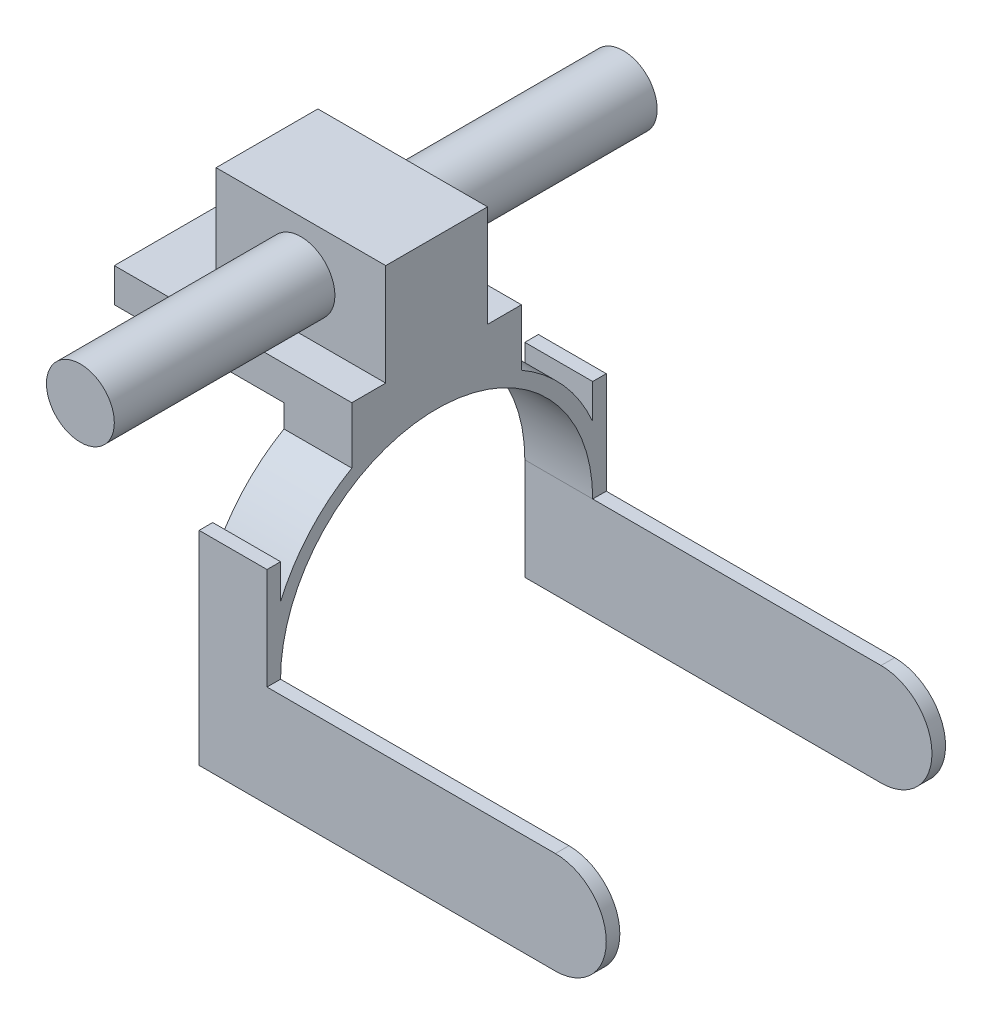
ISO-10303-21;
HEADER;
FILE_DESCRIPTION(('STEP AP214'),'2;1');
FILE_NAME('part.step','',(''),(''),'','','');
FILE_SCHEMA(('AUTOMOTIVE_DESIGN { 1 0 10303 214 1 1 1 1 }'));
ENDSEC;
DATA;
#1=APPLICATION_CONTEXT('core data for automotive mechanical design processes');
#2=APPLICATION_PROTOCOL_DEFINITION('international standard','automotive_design',2000,#1);
#3=PRODUCT_CONTEXT('',#1,'mechanical');
#4=PRODUCT('Part','Part','',(#3));
#5=PRODUCT_RELATED_PRODUCT_CATEGORY('part','',(#4));
#6=PRODUCT_DEFINITION_FORMATION('','',#4);
#7=PRODUCT_DEFINITION_CONTEXT('part definition',#1,'design');
#8=PRODUCT_DEFINITION('design','',#6,#7);
#9=PRODUCT_DEFINITION_SHAPE('','',#8);
#10=(LENGTH_UNIT() NAMED_UNIT(*) SI_UNIT(.MILLI.,.METRE.));
#11=(NAMED_UNIT(*) PLANE_ANGLE_UNIT() SI_UNIT($,.RADIAN.));
#12=(NAMED_UNIT(*) SI_UNIT($,.STERADIAN.) SOLID_ANGLE_UNIT());
#13=UNCERTAINTY_MEASURE_WITH_UNIT(LENGTH_MEASURE(1.E-05),#10,'distance_accuracy_value','');
#14=(GEOMETRIC_REPRESENTATION_CONTEXT(3) GLOBAL_UNCERTAINTY_ASSIGNED_CONTEXT((#13)) GLOBAL_UNIT_ASSIGNED_CONTEXT((#10,
#11,#12)) REPRESENTATION_CONTEXT('',''));
#15=CARTESIAN_POINT('',(0.,0.,0.));
#16=DIRECTION('',(0.,0.,1.));
#17=DIRECTION('',(1.,0.,0.));
#18=AXIS2_PLACEMENT_3D('',#15,#16,#17);
#19=CARTESIAN_POINT('',(20.,5.,25.));
#20=DIRECTION('',(0.,-1.,0.));
#21=DIRECTION('',(0.,0.,-1.));
#22=AXIS2_PLACEMENT_3D('',#19,#20,#21);
#23=PLANE('',#22);
#24=DIRECTION('',(1.,0.,0.));
#25=VECTOR('',#24,1.);
#26=CARTESIAN_POINT('',(20.,5.,15.));
#27=LINE('',#26,#25);
#28=CARTESIAN_POINT('',(-30.,5.,15.));
#29=VERTEX_POINT('',#28);
#30=CARTESIAN_POINT('',(20.,5.,15.));
#31=VERTEX_POINT('',#30);
#32=EDGE_CURVE('E54',#29,#31,#27,.T.);
#33=ORIENTED_EDGE('',*,*,#32,.F.);
#34=DIRECTION('',(0.,0.,1.));
#35=VECTOR('',#34,1.);
#36=CARTESIAN_POINT('',(-30.,5.,-15.));
#37=LINE('',#36,#35);
#38=CARTESIAN_POINT('',(-30.,5.,-15.));
#39=VERTEX_POINT('',#38);
#40=EDGE_CURVE('E403',#39,#29,#37,.T.);
#41=ORIENTED_EDGE('',*,*,#40,.F.);
#42=DIRECTION('',(-1.,0.,0.));
#43=VECTOR('',#42,1.);
#44=CARTESIAN_POINT('',(20.,5.,-15.));
#45=LINE('',#44,#43);
#46=CARTESIAN_POINT('',(20.,5.,-15.));
#47=VERTEX_POINT('',#46);
#48=EDGE_CURVE('E409',#47,#39,#45,.T.);
#49=ORIENTED_EDGE('',*,*,#48,.F.);
#50=DIRECTION('',(0.,0.,1.));
#51=VECTOR('',#50,1.);
#52=CARTESIAN_POINT('',(20.,5.,25.));
#53=LINE('',#52,#51);
#54=CARTESIAN_POINT('',(20.,5.,-25.));
#55=VERTEX_POINT('',#54);
#56=EDGE_CURVE('E229',#55,#47,#53,.T.);
#57=ORIENTED_EDGE('',*,*,#56,.F.);
#58=DIRECTION('',(-1.,0.,0.));
#59=VECTOR('',#58,1.);
#60=CARTESIAN_POINT('',(20.,5.,-25.));
#61=LINE('',#60,#59);
#62=CARTESIAN_POINT('',(-50.,5.,-25.));
#63=VERTEX_POINT('',#62);
#64=EDGE_CURVE('E348',#55,#63,#61,.T.);
#65=ORIENTED_EDGE('',*,*,#64,.T.);
#66=DIRECTION('',(0.,0.,-1.));
#67=VECTOR('',#66,1.);
#68=CARTESIAN_POINT('',(-50.,5.,-25.));
#69=LINE('',#68,#67);
#70=CARTESIAN_POINT('',(-50.,5.,25.));
#71=VERTEX_POINT('',#70);
#72=EDGE_CURVE('E246',#71,#63,#69,.T.);
#73=ORIENTED_EDGE('',*,*,#72,.F.);
#74=DIRECTION('',(-1.,0.,0.));
#75=VECTOR('',#74,1.);
#76=CARTESIAN_POINT('',(20.,5.,25.));
#77=LINE('',#76,#75);
#78=CARTESIAN_POINT('',(20.,5.,25.));
#79=VERTEX_POINT('',#78);
#80=EDGE_CURVE('E312',#79,#71,#77,.T.);
#81=ORIENTED_EDGE('',*,*,#80,.F.);
#82=EDGE_CURVE('E59',#31,#79,#53,.T.);
#83=ORIENTED_EDGE('',*,*,#82,.F.);
#84=EDGE_LOOP('',(#33,#41,#49,#57,#65,#73,#81,#83));
#85=FACE_BOUND('',#84,.T.);
#86=ADVANCED_FACE('F38',(#85),#23,.F.);
#87=CARTESIAN_POINT('',(0.,-55.0830621590042,0.));
#88=DIRECTION('',(1.,0.,0.));
#89=DIRECTION('',(0.,0.,-1.));
#90=AXIS2_PLACEMENT_3D('',#87,#88,#89);
#91=PLANE('',#90);
#92=DIRECTION('',(0.,0.,1.));
#93=VECTOR('',#92,1.);
#94=CARTESIAN_POINT('',(0.,-5.,-25.));
#95=LINE('',#94,#93);
#96=CARTESIAN_POINT('',(0.,-5.,-25.));
#97=VERTEX_POINT('',#96);
#98=CARTESIAN_POINT('',(0.,-5.,25.));
#99=VERTEX_POINT('',#98);
#100=EDGE_CURVE('E230',#97,#99,#95,.T.);
#101=ORIENTED_EDGE('',*,*,#100,.F.);
#102=DIRECTION('',(0.,1.,0.));
#103=VECTOR('',#102,1.);
#104=CARTESIAN_POINT('',(0.,5.,-25.));
#105=LINE('',#104,#103);
#106=CARTESIAN_POINT('',(0.,-11.6987772179597,-25.));
#107=VERTEX_POINT('',#106);
#108=EDGE_CURVE('E290',#107,#97,#105,.T.);
#109=ORIENTED_EDGE('',*,*,#108,.F.);
#110=CARTESIAN_POINT('',(0.,-55.0830621590042,0.));
#111=DIRECTION('',(1.,0.,0.));
#112=DIRECTION('',(0.,0.,-1.));
#113=AXIS2_PLACEMENT_3D('',#110,#111,#112);
#114=CIRCLE('',#113,50.0719100878501);
#115=CARTESIAN_POINT('',(0.,-35.304382227175,-46.));
#116=VERTEX_POINT('',#115);
#117=EDGE_CURVE('E342',#116,#107,#114,.T.);
#118=ORIENTED_EDGE('',*,*,#117,.F.);
#119=DIRECTION('',(0.,-1.,0.));
#120=VECTOR('',#119,1.);
#121=CARTESIAN_POINT('',(0.,-25.0830621590042,-46.));
#122=LINE('',#121,#120);
#123=CARTESIAN_POINT('',(0.,-25.0830621590042,-46.));
#124=VERTEX_POINT('',#123);
#125=EDGE_CURVE('E340',#124,#116,#122,.T.);
#126=ORIENTED_EDGE('',*,*,#125,.F.);
#127=DIRECTION('',(0.,0.,1.));
#128=VECTOR('',#127,1.);
#129=CARTESIAN_POINT('',(0.,-25.0830621590042,-46.));
#130=LINE('',#129,#128);
#131=CARTESIAN_POINT('',(0.,-25.0830621590042,-50.));
#132=VERTEX_POINT('',#131);
#133=EDGE_CURVE('E338',#132,#124,#130,.T.);
#134=ORIENTED_EDGE('',*,*,#133,.F.);
#135=DIRECTION('',(0.,1.,0.));
#136=VECTOR('',#135,1.);
#137=CARTESIAN_POINT('',(0.,-25.0830621590042,-50.));
#138=LINE('',#137,#136);
#139=CARTESIAN_POINT('',(0.,-85.0830621590042,-50.));
#140=VERTEX_POINT('',#139);
#141=EDGE_CURVE('E336',#140,#132,#138,.T.);
#142=ORIENTED_EDGE('',*,*,#141,.F.);
#143=DIRECTION('',(0.,0.,-1.));
#144=VECTOR('',#143,1.);
#145=CARTESIAN_POINT('',(0.,-85.0830621590043,-46.));
#146=LINE('',#145,#144);
#147=CARTESIAN_POINT('',(0.,-85.0830621590043,-46.));
#148=VERTEX_POINT('',#147);
#149=EDGE_CURVE('E333',#148,#140,#146,.T.);
#150=ORIENTED_EDGE('',*,*,#149,.F.);
#151=DIRECTION('',(0.,-1.,0.));
#152=VECTOR('',#151,1.);
#153=CARTESIAN_POINT('',(0.,-55.0830621590042,-46.));
#154=LINE('',#153,#152);
#155=CARTESIAN_POINT('',(0.,-55.0830621590042,-46.));
#156=VERTEX_POINT('',#155);
#157=EDGE_CURVE('E330',#156,#148,#154,.T.);
#158=ORIENTED_EDGE('',*,*,#157,.F.);
#159=CARTESIAN_POINT('',(0.,-55.0830621590042,0.));
#160=DIRECTION('',(-1.,0.,0.));
#161=DIRECTION('',(0.,0.,-1.));
#162=AXIS2_PLACEMENT_3D('',#159,#160,#161);
#163=CIRCLE('',#162,46.);
#164=CARTESIAN_POINT('',(0.,-55.0830621590042,46.));
#165=VERTEX_POINT('',#164);
#166=EDGE_CURVE('E328',#165,#156,#163,.T.);
#167=ORIENTED_EDGE('',*,*,#166,.F.);
#168=DIRECTION('',(0.,1.,0.));
#169=VECTOR('',#168,1.);
#170=CARTESIAN_POINT('',(0.,-55.0830621590042,46.));
#171=LINE('',#170,#169);
#172=CARTESIAN_POINT('',(0.,-85.0830621590042,46.));
#173=VERTEX_POINT('',#172);
#174=EDGE_CURVE('E326',#173,#165,#171,.T.);
#175=ORIENTED_EDGE('',*,*,#174,.F.);
#176=DIRECTION('',(0.,0.,-1.));
#177=VECTOR('',#176,1.);
#178=CARTESIAN_POINT('',(0.,-85.0830621590042,50.));
#179=LINE('',#178,#177);
#180=CARTESIAN_POINT('',(0.,-85.0830621590042,50.));
#181=VERTEX_POINT('',#180);
#182=EDGE_CURVE('E323',#181,#173,#179,.T.);
#183=ORIENTED_EDGE('',*,*,#182,.F.);
#184=DIRECTION('',(0.,-1.,0.));
#185=VECTOR('',#184,1.);
#186=CARTESIAN_POINT('',(0.,-25.0830621590042,50.));
#187=LINE('',#186,#185);
#188=CARTESIAN_POINT('',(0.,-25.0830621590042,50.));
#189=VERTEX_POINT('',#188);
#190=EDGE_CURVE('E320',#189,#181,#187,.T.);
#191=ORIENTED_EDGE('',*,*,#190,.F.);
#192=DIRECTION('',(0.,0.,1.));
#193=VECTOR('',#192,1.);
#194=CARTESIAN_POINT('',(0.,-25.0830621590042,50.));
#195=LINE('',#194,#193);
#196=CARTESIAN_POINT('',(0.,-25.0830621590042,46.));
#197=VERTEX_POINT('',#196);
#198=EDGE_CURVE('E318',#197,#189,#195,.T.);
#199=ORIENTED_EDGE('',*,*,#198,.F.);
#200=DIRECTION('',(0.,1.,0.));
#201=VECTOR('',#200,1.);
#202=CARTESIAN_POINT('',(0.,-25.0830621590042,46.));
#203=LINE('',#202,#201);
#204=CARTESIAN_POINT('',(0.,-35.304382227175,46.));
#205=VERTEX_POINT('',#204);
#206=EDGE_CURVE('E316',#205,#197,#203,.T.);
#207=ORIENTED_EDGE('',*,*,#206,.F.);
#208=CARTESIAN_POINT('',(0.,-55.0830621590042,0.));
#209=DIRECTION('',(1.,0.,0.));
#210=DIRECTION('',(0.,0.,-1.));
#211=AXIS2_PLACEMENT_3D('',#208,#209,#210);
#212=CIRCLE('',#211,50.0719100878501);
#213=CARTESIAN_POINT('',(0.,-11.6987772179597,25.));
#214=VERTEX_POINT('',#213);
#215=EDGE_CURVE('E314',#214,#205,#212,.T.);
#216=ORIENTED_EDGE('',*,*,#215,.F.);
#217=DIRECTION('',(0.,-1.,0.));
#218=VECTOR('',#217,1.);
#219=CARTESIAN_POINT('',(0.,-5.,25.));
#220=LINE('',#219,#218);
#221=EDGE_CURVE('E286',#99,#214,#220,.T.);
#222=ORIENTED_EDGE('',*,*,#221,.F.);
#223=EDGE_LOOP('',(#101,#109,#118,#126,#134,#142,#150,#158,#167,#175,#183,#191,#199,#207,#216,#222));
#224=FACE_BOUND('',#223,.T.);
#225=ADVANCED_FACE('F434',(#224),#91,.F.);
#226=CARTESIAN_POINT('',(20.,-85.0830621590042,50.));
#227=DIRECTION('',(0.,1.,0.));
#228=DIRECTION('',(0.,0.,1.));
#229=AXIS2_PLACEMENT_3D('',#226,#227,#228);
#230=PLANE('',#229);
#231=DIRECTION('',(0.,0.,1.));
#232=VECTOR('',#231,1.);
#233=CARTESIAN_POINT('',(105.,-85.0830621590042,-50.));
#234=LINE('',#233,#232);
#235=CARTESIAN_POINT('',(105.,-85.0830621590042,46.));
#236=VERTEX_POINT('',#235);
#237=CARTESIAN_POINT('',(105.,-85.0830621590042,50.));
#238=VERTEX_POINT('',#237);
#239=EDGE_CURVE('E259',#236,#238,#234,.T.);
#240=ORIENTED_EDGE('',*,*,#239,.T.);
#241=DIRECTION('',(-1.,0.,0.));
#242=VECTOR('',#241,1.);
#243=CARTESIAN_POINT('',(20.,-85.0830621590042,50.));
#244=LINE('',#243,#242);
#245=EDGE_CURVE('E374',#238,#181,#244,.T.);
#246=ORIENTED_EDGE('',*,*,#245,.T.);
#247=ORIENTED_EDGE('',*,*,#182,.T.);
#248=DIRECTION('',(-1.,0.,0.));
#249=VECTOR('',#248,1.);
#250=CARTESIAN_POINT('',(20.,-85.0830621590042,46.));
#251=LINE('',#250,#249);
#252=EDGE_CURVE('E372',#236,#173,#251,.T.);
#253=ORIENTED_EDGE('',*,*,#252,.F.);
#254=EDGE_LOOP('',(#240,#246,#247,#253));
#255=FACE_BOUND('',#254,.T.);
#256=ADVANCED_FACE('F439',(#255),#230,.F.);
#257=CARTESIAN_POINT('',(20.,-85.0830621590043,-46.));
#258=DIRECTION('',(0.,1.,0.));
#259=DIRECTION('',(0.,0.,1.));
#260=AXIS2_PLACEMENT_3D('',#257,#258,#259);
#261=PLANE('',#260);
#262=CARTESIAN_POINT('',(105.,-85.0830621590042,-50.));
#263=VERTEX_POINT('',#262);
#264=CARTESIAN_POINT('',(105.,-85.0830621590042,-46.));
#265=VERTEX_POINT('',#264);
#266=EDGE_CURVE('E266',#263,#265,#234,.T.);
#267=ORIENTED_EDGE('',*,*,#266,.T.);
#268=DIRECTION('',(-1.,0.,0.));
#269=VECTOR('',#268,1.);
#270=CARTESIAN_POINT('',(20.,-85.0830621590043,-46.));
#271=LINE('',#270,#269);
#272=EDGE_CURVE('E364',#265,#148,#271,.T.);
#273=ORIENTED_EDGE('',*,*,#272,.T.);
#274=ORIENTED_EDGE('',*,*,#149,.T.);
#275=DIRECTION('',(-1.,0.,0.));
#276=VECTOR('',#275,1.);
#277=CARTESIAN_POINT('',(20.,-85.0830621590042,-50.));
#278=LINE('',#277,#276);
#279=EDGE_CURVE('E362',#263,#140,#278,.T.);
#280=ORIENTED_EDGE('',*,*,#279,.F.);
#281=EDGE_LOOP('',(#267,#273,#274,#280));
#282=FACE_BOUND('',#281,.T.);
#283=ADVANCED_FACE('F466',(#282),#261,.F.);
#284=CARTESIAN_POINT('',(20.,-55.0830621590042,0.));
#285=DIRECTION('',(1.,0.,0.));
#286=DIRECTION('',(0.,0.,-1.));
#287=AXIS2_PLACEMENT_3D('',#284,#285,#286);
#288=PLANE('',#287);
#289=CARTESIAN_POINT('',(20.,-55.0830621590042,0.));
#290=DIRECTION('',(-1.,0.,0.));
#291=DIRECTION('',(0.,0.,-1.));
#292=AXIS2_PLACEMENT_3D('',#289,#290,#291);
#293=CIRCLE('',#292,46.);
#294=CARTESIAN_POINT('',(20.,-55.0830621590042,46.));
#295=VERTEX_POINT('',#294);
#296=CARTESIAN_POINT('',(20.,-55.0830621590042,-46.));
#297=VERTEX_POINT('',#296);
#298=EDGE_CURVE('E299',#295,#297,#293,.T.);
#299=ORIENTED_EDGE('',*,*,#298,.T.);
#300=DIRECTION('',(0.,0.,1.));
#301=VECTOR('',#300,1.);
#302=CARTESIAN_POINT('',(20.,-55.0830621590042,-46.));
#303=LINE('',#302,#301);
#304=CARTESIAN_POINT('',(20.,-55.0830621590042,-50.));
#305=VERTEX_POINT('',#304);
#306=EDGE_CURVE('E272',#305,#297,#303,.T.);
#307=ORIENTED_EDGE('',*,*,#306,.F.);
#308=DIRECTION('',(0.,1.,0.));
#309=VECTOR('',#308,1.);
#310=CARTESIAN_POINT('',(20.,-25.0830621590042,-50.));
#311=LINE('',#310,#309);
#312=CARTESIAN_POINT('',(20.,-25.0830621590042,-50.));
#313=VERTEX_POINT('',#312);
#314=EDGE_CURVE('E301',#305,#313,#311,.T.);
#315=ORIENTED_EDGE('',*,*,#314,.T.);
#316=DIRECTION('',(0.,0.,1.));
#317=VECTOR('',#316,1.);
#318=CARTESIAN_POINT('',(20.,-25.0830621590042,-46.));
#319=LINE('',#318,#317);
#320=CARTESIAN_POINT('',(20.,-25.0830621590042,-46.));
#321=VERTEX_POINT('',#320);
#322=EDGE_CURVE('E303',#313,#321,#319,.T.);
#323=ORIENTED_EDGE('',*,*,#322,.T.);
#324=DIRECTION('',(0.,-1.,0.));
#325=VECTOR('',#324,1.);
#326=CARTESIAN_POINT('',(20.,-25.0830621590042,-46.));
#327=LINE('',#326,#325);
#328=CARTESIAN_POINT('',(20.,-35.304382227175,-46.));
#329=VERTEX_POINT('',#328);
#330=EDGE_CURVE('E305',#321,#329,#327,.T.);
#331=ORIENTED_EDGE('',*,*,#330,.T.);
#332=CARTESIAN_POINT('',(20.,-55.0830621590042,0.));
#333=DIRECTION('',(1.,0.,0.));
#334=DIRECTION('',(0.,0.,-1.));
#335=AXIS2_PLACEMENT_3D('',#332,#333,#334);
#336=CIRCLE('',#335,50.0719100878501);
#337=CARTESIAN_POINT('',(20.,-11.6987772179597,-25.));
#338=VERTEX_POINT('',#337);
#339=EDGE_CURVE('E307',#329,#338,#336,.T.);
#340=ORIENTED_EDGE('',*,*,#339,.T.);
#341=DIRECTION('',(0.,1.,0.));
#342=VECTOR('',#341,1.);
#343=CARTESIAN_POINT('',(20.,-5.,-25.));
#344=LINE('',#343,#342);
#345=EDGE_CURVE('E309',#338,#55,#344,.T.);
#346=ORIENTED_EDGE('',*,*,#345,.T.);
#347=ORIENTED_EDGE('',*,*,#56,.T.);
#348=DIRECTION('',(0.,-1.,0.));
#349=VECTOR('',#348,1.);
#350=CARTESIAN_POINT('',(20.,35.,-15.));
#351=LINE('',#350,#349);
#352=CARTESIAN_POINT('',(20.,35.,-15.));
#353=VERTEX_POINT('',#352);
#354=EDGE_CURVE('E209',#353,#47,#351,.T.);
#355=ORIENTED_EDGE('',*,*,#354,.F.);
#356=DIRECTION('',(0.,0.,-1.));
#357=VECTOR('',#356,1.);
#358=CARTESIAN_POINT('',(20.,35.,-15.));
#359=LINE('',#358,#357);
#360=CARTESIAN_POINT('',(20.,35.,15.));
#361=VERTEX_POINT('',#360);
#362=EDGE_CURVE('E215',#361,#353,#359,.T.);
#363=ORIENTED_EDGE('',*,*,#362,.F.);
#364=DIRECTION('',(0.,-1.,0.));
#365=VECTOR('',#364,1.);
#366=CARTESIAN_POINT('',(20.,35.,15.));
#367=LINE('',#366,#365);
#368=EDGE_CURVE('E401',#361,#31,#367,.T.);
#369=ORIENTED_EDGE('',*,*,#368,.T.);
#370=ORIENTED_EDGE('',*,*,#82,.T.);
#371=DIRECTION('',(0.,-1.,0.));
#372=VECTOR('',#371,1.);
#373=CARTESIAN_POINT('',(20.,5.,25.));
#374=LINE('',#373,#372);
#375=CARTESIAN_POINT('',(20.,-11.6987772179597,25.));
#376=VERTEX_POINT('',#375);
#377=EDGE_CURVE('E287',#79,#376,#374,.T.);
#378=ORIENTED_EDGE('',*,*,#377,.T.);
#379=CARTESIAN_POINT('',(20.,-55.0830621590042,0.));
#380=DIRECTION('',(1.,0.,0.));
#381=DIRECTION('',(0.,0.,-1.));
#382=AXIS2_PLACEMENT_3D('',#379,#380,#381);
#383=CIRCLE('',#382,50.0719100878501);
#384=CARTESIAN_POINT('',(20.,-35.304382227175,46.));
#385=VERTEX_POINT('',#384);
#386=EDGE_CURVE('E289',#376,#385,#383,.T.);
#387=ORIENTED_EDGE('',*,*,#386,.T.);
#388=DIRECTION('',(0.,1.,0.));
#389=VECTOR('',#388,1.);
#390=CARTESIAN_POINT('',(20.,-25.0830621590042,46.));
#391=LINE('',#390,#389);
#392=CARTESIAN_POINT('',(20.,-25.0830621590042,46.));
#393=VERTEX_POINT('',#392);
#394=EDGE_CURVE('E292',#385,#393,#391,.T.);
#395=ORIENTED_EDGE('',*,*,#394,.T.);
#396=DIRECTION('',(0.,0.,1.));
#397=VECTOR('',#396,1.);
#398=CARTESIAN_POINT('',(20.,-25.0830621590042,50.));
#399=LINE('',#398,#397);
#400=CARTESIAN_POINT('',(20.,-25.0830621590042,50.));
#401=VERTEX_POINT('',#400);
#402=EDGE_CURVE('E294',#393,#401,#399,.T.);
#403=ORIENTED_EDGE('',*,*,#402,.T.);
#404=DIRECTION('',(0.,-1.,0.));
#405=VECTOR('',#404,1.);
#406=CARTESIAN_POINT('',(20.,-25.0830621590042,50.));
#407=LINE('',#406,#405);
#408=CARTESIAN_POINT('',(20.,-55.0830621590042,50.));
#409=VERTEX_POINT('',#408);
#410=EDGE_CURVE('E296',#401,#409,#407,.T.);
#411=ORIENTED_EDGE('',*,*,#410,.T.);
#412=DIRECTION('',(0.,0.,1.));
#413=VECTOR('',#412,1.);
#414=CARTESIAN_POINT('',(20.,-55.0830621590042,50.));
#415=LINE('',#414,#413);
#416=EDGE_CURVE('E279',#295,#409,#415,.T.);
#417=ORIENTED_EDGE('',*,*,#416,.F.);
#418=EDGE_LOOP('',(#299,#307,#315,#323,#331,#340,#346,#347,#355,#363,#369,#370,#378,#387,#395,
#403,#411,#417));
#419=FACE_BOUND('',#418,.T.);
#420=ADVANCED_FACE('F227',(#419),#288,.T.);
#421=CARTESIAN_POINT('',(20.,-5.,25.));
#422=DIRECTION('',(0.,0.,-1.));
#423=DIRECTION('',(-1.,0.,0.));
#424=AXIS2_PLACEMENT_3D('',#421,#422,#423);
#425=PLANE('',#424);
#426=ORIENTED_EDGE('',*,*,#80,.T.);
#427=DIRECTION('',(0.,1.,0.));
#428=VECTOR('',#427,1.);
#429=CARTESIAN_POINT('',(-50.,5.,25.));
#430=LINE('',#429,#428);
#431=CARTESIAN_POINT('',(-50.,-5.,25.));
#432=VERTEX_POINT('',#431);
#433=EDGE_CURVE('E243',#432,#71,#430,.T.);
#434=ORIENTED_EDGE('',*,*,#433,.F.);
#435=DIRECTION('',(1.,0.,0.));
#436=VECTOR('',#435,1.);
#437=CARTESIAN_POINT('',(-50.,-5.,25.));
#438=LINE('',#437,#436);
#439=EDGE_CURVE('E248',#432,#99,#438,.T.);
#440=ORIENTED_EDGE('',*,*,#439,.T.);
#441=ORIENTED_EDGE('',*,*,#221,.T.);
#442=DIRECTION('',(-1.,0.,0.));
#443=VECTOR('',#442,1.);
#444=CARTESIAN_POINT('',(20.,-11.6987772179597,25.));
#445=LINE('',#444,#443);
#446=EDGE_CURVE('E384',#376,#214,#445,.T.);
#447=ORIENTED_EDGE('',*,*,#446,.F.);
#448=ORIENTED_EDGE('',*,*,#377,.F.);
#449=EDGE_LOOP('',(#426,#434,#440,#441,#447,#448));
#450=FACE_BOUND('',#449,.T.);
#451=ADVANCED_FACE('F40',(#450),#425,.F.);
#452=CARTESIAN_POINT('',(20.,-55.0830621590042,0.));
#453=DIRECTION('',(-1.,0.,0.));
#454=DIRECTION('',(0.,0.,1.));
#455=AXIS2_PLACEMENT_3D('',#452,#453,#454);
#456=CYLINDRICAL_SURFACE('',#455,50.0719100878501);
#457=ORIENTED_EDGE('',*,*,#215,.T.);
#458=DIRECTION('',(-1.,0.,0.));
#459=VECTOR('',#458,1.);
#460=CARTESIAN_POINT('',(20.,-35.304382227175,46.));
#461=LINE('',#460,#459);
#462=EDGE_CURVE('E382',#385,#205,#461,.T.);
#463=ORIENTED_EDGE('',*,*,#462,.F.);
#464=ORIENTED_EDGE('',*,*,#386,.F.);
#465=ORIENTED_EDGE('',*,*,#446,.T.);
#466=EDGE_LOOP('',(#457,#463,#464,#465));
#467=FACE_BOUND('',#466,.T.);
#468=ADVANCED_FACE('F494',(#467),#456,.T.);
#469=CARTESIAN_POINT('',(20.,-25.0830621590042,46.));
#470=DIRECTION('',(0.,0.,1.));
#471=DIRECTION('',(1.,0.,0.));
#472=AXIS2_PLACEMENT_3D('',#469,#470,#471);
#473=PLANE('',#472);
#474=ORIENTED_EDGE('',*,*,#206,.T.);
#475=DIRECTION('',(-1.,0.,0.));
#476=VECTOR('',#475,1.);
#477=CARTESIAN_POINT('',(20.,-25.0830621590042,46.));
#478=LINE('',#477,#476);
#479=EDGE_CURVE('E379',#393,#197,#478,.T.);
#480=ORIENTED_EDGE('',*,*,#479,.F.);
#481=ORIENTED_EDGE('',*,*,#394,.F.);
#482=ORIENTED_EDGE('',*,*,#462,.T.);
#483=EDGE_LOOP('',(#474,#480,#481,#482));
#484=FACE_BOUND('',#483,.T.);
#485=ADVANCED_FACE('F491',(#484),#473,.F.);
#486=CARTESIAN_POINT('',(20.,-25.0830621590042,50.));
#487=DIRECTION('',(0.,-1.,0.));
#488=DIRECTION('',(0.,0.,-1.));
#489=AXIS2_PLACEMENT_3D('',#486,#487,#488);
#490=PLANE('',#489);
#491=ORIENTED_EDGE('',*,*,#198,.T.);
#492=DIRECTION('',(-1.,0.,0.));
#493=VECTOR('',#492,1.);
#494=CARTESIAN_POINT('',(20.,-25.0830621590042,50.));
#495=LINE('',#494,#493);
#496=EDGE_CURVE('E376',#401,#189,#495,.T.);
#497=ORIENTED_EDGE('',*,*,#496,.F.);
#498=ORIENTED_EDGE('',*,*,#402,.F.);
#499=ORIENTED_EDGE('',*,*,#479,.T.);
#500=EDGE_LOOP('',(#491,#497,#498,#499));
#501=FACE_BOUND('',#500,.T.);
#502=ADVANCED_FACE('F487',(#501),#490,.F.);
#503=CARTESIAN_POINT('',(20.,-25.0830621590042,50.));
#504=DIRECTION('',(0.,0.,-1.));
#505=DIRECTION('',(0.,1.,0.));
#506=AXIS2_PLACEMENT_3D('',#503,#504,#505);
#507=PLANE('',#506);
#508=ORIENTED_EDGE('',*,*,#245,.F.);
#509=CARTESIAN_POINT('',(105.,-70.0830621590042,50.));
#510=DIRECTION('',(0.,0.,-1.));
#511=DIRECTION('',(1.,0.,0.));
#512=AXIS2_PLACEMENT_3D('',#509,#510,#511);
#513=CIRCLE('',#512,15.);
#514=CARTESIAN_POINT('',(105.,-55.0830621590042,50.));
#515=VERTEX_POINT('',#514);
#516=EDGE_CURVE('E255',#515,#238,#513,.T.);
#517=ORIENTED_EDGE('',*,*,#516,.F.);
#518=DIRECTION('',(-1.,0.,0.));
#519=VECTOR('',#518,1.);
#520=CARTESIAN_POINT('',(120.,-55.0830621590042,50.));
#521=LINE('',#520,#519);
#522=EDGE_CURVE('E282',#515,#409,#521,.T.);
#523=ORIENTED_EDGE('',*,*,#522,.T.);
#524=ORIENTED_EDGE('',*,*,#410,.F.);
#525=ORIENTED_EDGE('',*,*,#496,.T.);
#526=ORIENTED_EDGE('',*,*,#190,.T.);
#527=EDGE_LOOP('',(#508,#517,#523,#524,#525,#526));
#528=FACE_BOUND('',#527,.T.);
#529=ADVANCED_FACE('F480',(#528),#507,.F.);
#530=CARTESIAN_POINT('',(20.,-55.0830621590042,46.));
#531=DIRECTION('',(0.,0.,1.));
#532=DIRECTION('',(0.,-1.,0.));
#533=AXIS2_PLACEMENT_3D('',#530,#531,#532);
#534=PLANE('',#533);
#535=DIRECTION('',(-1.,0.,0.));
#536=VECTOR('',#535,1.);
#537=CARTESIAN_POINT('',(120.,-55.0830621590042,46.));
#538=LINE('',#537,#536);
#539=CARTESIAN_POINT('',(105.,-55.0830621590042,46.));
#540=VERTEX_POINT('',#539);
#541=EDGE_CURVE('E284',#540,#295,#538,.T.);
#542=ORIENTED_EDGE('',*,*,#541,.F.);
#543=CARTESIAN_POINT('',(105.,-70.0830621590042,46.));
#544=DIRECTION('',(0.,0.,1.));
#545=DIRECTION('',(0.,-1.,0.));
#546=AXIS2_PLACEMENT_3D('',#543,#544,#545);
#547=CIRCLE('',#546,15.);
#548=EDGE_CURVE('E270',#540,#236,#547,.F.);
#549=ORIENTED_EDGE('',*,*,#548,.T.);
#550=ORIENTED_EDGE('',*,*,#252,.T.);
#551=ORIENTED_EDGE('',*,*,#174,.T.);
#552=DIRECTION('',(-1.,0.,0.));
#553=VECTOR('',#552,1.);
#554=CARTESIAN_POINT('',(20.,-55.0830621590042,46.));
#555=LINE('',#554,#553);
#556=EDGE_CURVE('E369',#295,#165,#555,.T.);
#557=ORIENTED_EDGE('',*,*,#556,.F.);
#558=EDGE_LOOP('',(#542,#549,#550,#551,#557));
#559=FACE_BOUND('',#558,.T.);
#560=ADVANCED_FACE('F476',(#559),#534,.F.);
#561=CARTESIAN_POINT('',(20.,-55.0830621590042,0.));
#562=DIRECTION('',(-1.,0.,0.));
#563=DIRECTION('',(0.,0.,1.));
#564=AXIS2_PLACEMENT_3D('',#561,#562,#563);
#565=CYLINDRICAL_SURFACE('',#564,46.);
#566=ORIENTED_EDGE('',*,*,#166,.T.);
#567=DIRECTION('',(-1.,0.,0.));
#568=VECTOR('',#567,1.);
#569=CARTESIAN_POINT('',(20.,-55.0830621590042,-46.));
#570=LINE('',#569,#568);
#571=EDGE_CURVE('E366',#297,#156,#570,.T.);
#572=ORIENTED_EDGE('',*,*,#571,.F.);
#573=ORIENTED_EDGE('',*,*,#298,.F.);
#574=ORIENTED_EDGE('',*,*,#556,.T.);
#575=EDGE_LOOP('',(#566,#572,#573,#574));
#576=FACE_BOUND('',#575,.T.);
#577=ADVANCED_FACE('F472',(#576),#565,.F.);
#578=CARTESIAN_POINT('',(20.,-55.0830621590042,-46.));
#579=DIRECTION('',(0.,0.,-1.));
#580=DIRECTION('',(0.,1.,0.));
#581=AXIS2_PLACEMENT_3D('',#578,#579,#580);
#582=PLANE('',#581);
#583=ORIENTED_EDGE('',*,*,#272,.F.);
#584=CARTESIAN_POINT('',(105.,-70.0830621590042,-46.));
#585=DIRECTION('',(0.,0.,-1.));
#586=DIRECTION('',(0.,1.,0.));
#587=AXIS2_PLACEMENT_3D('',#584,#585,#586);
#588=CIRCLE('',#587,15.);
#589=CARTESIAN_POINT('',(105.,-55.0830621590042,-46.));
#590=VERTEX_POINT('',#589);
#591=EDGE_CURVE('E264',#265,#590,#588,.F.);
#592=ORIENTED_EDGE('',*,*,#591,.T.);
#593=DIRECTION('',(-1.,0.,0.));
#594=VECTOR('',#593,1.);
#595=CARTESIAN_POINT('',(120.,-55.0830621590042,-46.));
#596=LINE('',#595,#594);
#597=EDGE_CURVE('E275',#590,#297,#596,.T.);
#598=ORIENTED_EDGE('',*,*,#597,.T.);
#599=ORIENTED_EDGE('',*,*,#571,.T.);
#600=ORIENTED_EDGE('',*,*,#157,.T.);
#601=EDGE_LOOP('',(#583,#592,#598,#599,#600));
#602=FACE_BOUND('',#601,.T.);
#603=ADVANCED_FACE('F464',(#602),#582,.F.);
#604=CARTESIAN_POINT('',(20.,-25.0830621590042,-50.));
#605=DIRECTION('',(0.,0.,1.));
#606=DIRECTION('',(0.,-1.,0.));
#607=AXIS2_PLACEMENT_3D('',#604,#605,#606);
#608=PLANE('',#607);
#609=DIRECTION('',(-1.,0.,0.));
#610=VECTOR('',#609,1.);
#611=CARTESIAN_POINT('',(120.,-55.0830621590042,-50.));
#612=LINE('',#611,#610);
#613=CARTESIAN_POINT('',(105.,-55.0830621590042,-50.));
#614=VERTEX_POINT('',#613);
#615=EDGE_CURVE('E277',#614,#305,#612,.T.);
#616=ORIENTED_EDGE('',*,*,#615,.F.);
#617=CARTESIAN_POINT('',(105.,-70.0830621590042,-50.));
#618=DIRECTION('',(0.,0.,-1.));
#619=DIRECTION('',(1.,0.,0.));
#620=AXIS2_PLACEMENT_3D('',#617,#618,#619);
#621=CIRCLE('',#620,15.);
#622=EDGE_CURVE('E256',#614,#263,#621,.T.);
#623=ORIENTED_EDGE('',*,*,#622,.T.);
#624=ORIENTED_EDGE('',*,*,#279,.T.);
#625=ORIENTED_EDGE('',*,*,#141,.T.);
#626=DIRECTION('',(-1.,0.,0.));
#627=VECTOR('',#626,1.);
#628=CARTESIAN_POINT('',(20.,-25.0830621590042,-50.));
#629=LINE('',#628,#627);
#630=EDGE_CURVE('E359',#313,#132,#629,.T.);
#631=ORIENTED_EDGE('',*,*,#630,.F.);
#632=ORIENTED_EDGE('',*,*,#314,.F.);
#633=EDGE_LOOP('',(#616,#623,#624,#625,#631,#632));
#634=FACE_BOUND('',#633,.T.);
#635=ADVANCED_FACE('F460',(#634),#608,.F.);
#636=CARTESIAN_POINT('',(20.,-25.0830621590042,-46.));
#637=DIRECTION('',(0.,-1.,0.));
#638=DIRECTION('',(0.,0.,-1.));
#639=AXIS2_PLACEMENT_3D('',#636,#637,#638);
#640=PLANE('',#639);
#641=ORIENTED_EDGE('',*,*,#133,.T.);
#642=DIRECTION('',(-1.,0.,0.));
#643=VECTOR('',#642,1.);
#644=CARTESIAN_POINT('',(20.,-25.0830621590042,-46.));
#645=LINE('',#644,#643);
#646=EDGE_CURVE('E356',#321,#124,#645,.T.);
#647=ORIENTED_EDGE('',*,*,#646,.F.);
#648=ORIENTED_EDGE('',*,*,#322,.F.);
#649=ORIENTED_EDGE('',*,*,#630,.T.);
#650=EDGE_LOOP('',(#641,#647,#648,#649));
#651=FACE_BOUND('',#650,.T.);
#652=ADVANCED_FACE('F456',(#651),#640,.F.);
#653=CARTESIAN_POINT('',(20.,-25.0830621590042,-46.));
#654=DIRECTION('',(0.,0.,-1.));
#655=DIRECTION('',(-1.,0.,0.));
#656=AXIS2_PLACEMENT_3D('',#653,#654,#655);
#657=PLANE('',#656);
#658=ORIENTED_EDGE('',*,*,#125,.T.);
#659=DIRECTION('',(-1.,0.,0.));
#660=VECTOR('',#659,1.);
#661=CARTESIAN_POINT('',(20.,-35.304382227175,-46.));
#662=LINE('',#661,#660);
#663=EDGE_CURVE('E353',#329,#116,#662,.T.);
#664=ORIENTED_EDGE('',*,*,#663,.F.);
#665=ORIENTED_EDGE('',*,*,#330,.F.);
#666=ORIENTED_EDGE('',*,*,#646,.T.);
#667=EDGE_LOOP('',(#658,#664,#665,#666));
#668=FACE_BOUND('',#667,.T.);
#669=ADVANCED_FACE('F452',(#668),#657,.F.);
#670=CARTESIAN_POINT('',(20.,-55.0830621590042,0.));
#671=DIRECTION('',(-1.,0.,0.));
#672=DIRECTION('',(0.,0.,1.));
#673=AXIS2_PLACEMENT_3D('',#670,#671,#672);
#674=CYLINDRICAL_SURFACE('',#673,50.0719100878501);
#675=ORIENTED_EDGE('',*,*,#117,.T.);
#676=DIRECTION('',(-1.,0.,0.));
#677=VECTOR('',#676,1.);
#678=CARTESIAN_POINT('',(20.,-11.6987772179597,-25.));
#679=LINE('',#678,#677);
#680=EDGE_CURVE('E350',#338,#107,#679,.T.);
#681=ORIENTED_EDGE('',*,*,#680,.F.);
#682=ORIENTED_EDGE('',*,*,#339,.F.);
#683=ORIENTED_EDGE('',*,*,#663,.T.);
#684=EDGE_LOOP('',(#675,#681,#682,#683));
#685=FACE_BOUND('',#684,.T.);
#686=ADVANCED_FACE('F448',(#685),#674,.T.);
#687=CARTESIAN_POINT('',(20.,5.,-25.));
#688=DIRECTION('',(0.,0.,1.));
#689=DIRECTION('',(1.,0.,0.));
#690=AXIS2_PLACEMENT_3D('',#687,#688,#689);
#691=PLANE('',#690);
#692=ORIENTED_EDGE('',*,*,#108,.T.);
#693=DIRECTION('',(1.,0.,0.));
#694=VECTOR('',#693,1.);
#695=CARTESIAN_POINT('',(-50.,-5.,-25.));
#696=LINE('',#695,#694);
#697=CARTESIAN_POINT('',(-50.,-5.,-25.));
#698=VERTEX_POINT('',#697);
#699=EDGE_CURVE('E252',#698,#97,#696,.T.);
#700=ORIENTED_EDGE('',*,*,#699,.F.);
#701=DIRECTION('',(0.,-1.,0.));
#702=VECTOR('',#701,1.);
#703=CARTESIAN_POINT('',(-50.,5.,-25.));
#704=LINE('',#703,#702);
#705=EDGE_CURVE('E233',#63,#698,#704,.T.);
#706=ORIENTED_EDGE('',*,*,#705,.F.);
#707=ORIENTED_EDGE('',*,*,#64,.F.);
#708=ORIENTED_EDGE('',*,*,#345,.F.);
#709=ORIENTED_EDGE('',*,*,#680,.T.);
#710=EDGE_LOOP('',(#692,#700,#706,#707,#708,#709));
#711=FACE_BOUND('',#710,.T.);
#712=ADVANCED_FACE('F444',(#711),#691,.F.);
#713=CARTESIAN_POINT('',(120.,-55.0830621590042,50.));
#714=DIRECTION('',(0.,-1.,0.));
#715=DIRECTION('',(0.,0.,-1.));
#716=AXIS2_PLACEMENT_3D('',#713,#714,#715);
#717=PLANE('',#716);
#718=ORIENTED_EDGE('',*,*,#522,.F.);
#719=DIRECTION('',(0.,0.,1.));
#720=VECTOR('',#719,1.);
#721=CARTESIAN_POINT('',(105.,-55.0830621590042,-50.));
#722=LINE('',#721,#720);
#723=EDGE_CURVE('E265',#540,#515,#722,.T.);
#724=ORIENTED_EDGE('',*,*,#723,.F.);
#725=ORIENTED_EDGE('',*,*,#541,.T.);
#726=ORIENTED_EDGE('',*,*,#416,.T.);
#727=EDGE_LOOP('',(#718,#724,#725,#726));
#728=FACE_BOUND('',#727,.T.);
#729=ADVANCED_FACE('F447',(#728),#717,.F.);
#730=CARTESIAN_POINT('',(120.,-55.0830621590042,-46.));
#731=DIRECTION('',(0.,-1.,0.));
#732=DIRECTION('',(0.,0.,-1.));
#733=AXIS2_PLACEMENT_3D('',#730,#731,#732);
#734=PLANE('',#733);
#735=ORIENTED_EDGE('',*,*,#597,.F.);
#736=EDGE_CURVE('E261',#614,#590,#722,.T.);
#737=ORIENTED_EDGE('',*,*,#736,.F.);
#738=ORIENTED_EDGE('',*,*,#615,.T.);
#739=ORIENTED_EDGE('',*,*,#306,.T.);
#740=EDGE_LOOP('',(#735,#737,#738,#739));
#741=FACE_BOUND('',#740,.T.);
#742=ADVANCED_FACE('F567',(#741),#734,.F.);
#743=CARTESIAN_POINT('',(105.,-70.0830621590042,-50.));
#744=DIRECTION('',(0.,0.,1.));
#745=DIRECTION('',(1.,0.,0.));
#746=AXIS2_PLACEMENT_3D('',#743,#744,#745);
#747=CYLINDRICAL_SURFACE('',#746,15.);
#748=ORIENTED_EDGE('',*,*,#266,.F.);
#749=ORIENTED_EDGE('',*,*,#622,.F.);
#750=ORIENTED_EDGE('',*,*,#736,.T.);
#751=ORIENTED_EDGE('',*,*,#591,.F.);
#752=EDGE_LOOP('',(#748,#749,#750,#751));
#753=FACE_BOUND('',#752,.T.);
#754=ADVANCED_FACE('F565',(#753),#747,.T.);
#755=ORIENTED_EDGE('',*,*,#723,.T.);
#756=ORIENTED_EDGE('',*,*,#516,.T.);
#757=ORIENTED_EDGE('',*,*,#239,.F.);
#758=ORIENTED_EDGE('',*,*,#548,.F.);
#759=EDGE_LOOP('',(#755,#756,#757,#758));
#760=FACE_BOUND('',#759,.T.);
#761=ADVANCED_FACE('F561',(#760),#747,.T.);
#762=CARTESIAN_POINT('',(-50.,-5.,-25.));
#763=DIRECTION('',(0.,1.,0.));
#764=DIRECTION('',(0.,0.,1.));
#765=AXIS2_PLACEMENT_3D('',#762,#763,#764);
#766=PLANE('',#765);
#767=ORIENTED_EDGE('',*,*,#100,.T.);
#768=ORIENTED_EDGE('',*,*,#439,.F.);
#769=DIRECTION('',(0.,0.,1.));
#770=VECTOR('',#769,1.);
#771=CARTESIAN_POINT('',(-50.,-5.,-25.));
#772=LINE('',#771,#770);
#773=EDGE_CURVE('E241',#698,#432,#772,.T.);
#774=ORIENTED_EDGE('',*,*,#773,.F.);
#775=ORIENTED_EDGE('',*,*,#699,.T.);
#776=EDGE_LOOP('',(#767,#768,#774,#775));
#777=FACE_BOUND('',#776,.T.);
#778=ADVANCED_FACE('F557',(#777),#766,.F.);
#779=CARTESIAN_POINT('',(-50.,0.,0.));
#780=DIRECTION('',(-1.,0.,0.));
#781=DIRECTION('',(0.,0.,1.));
#782=AXIS2_PLACEMENT_3D('',#779,#780,#781);
#783=PLANE('',#782);
#784=ORIENTED_EDGE('',*,*,#705,.T.);
#785=ORIENTED_EDGE('',*,*,#773,.T.);
#786=ORIENTED_EDGE('',*,*,#433,.T.);
#787=ORIENTED_EDGE('',*,*,#72,.T.);
#788=EDGE_LOOP('',(#784,#785,#786,#787));
#789=FACE_BOUND('',#788,.T.);
#790=ADVANCED_FACE('F551',(#789),#783,.T.);
#791=CARTESIAN_POINT('',(20.,35.,-15.));
#792=DIRECTION('',(0.,0.,1.));
#793=DIRECTION('',(1.,0.,0.));
#794=AXIS2_PLACEMENT_3D('',#791,#792,#793);
#795=PLANE('',#794);
#796=CARTESIAN_POINT('',(-4.99999999999999,19.8918080832778,-15.));
#797=DIRECTION('',(0.,0.,1.));
#798=DIRECTION('',(1.,0.,0.));
#799=AXIS2_PLACEMENT_3D('',#796,#797,#798);
#800=CIRCLE('',#799,10.);
#801=CARTESIAN_POINT('',(5.00000000000001,19.8918080832778,-15.));
#802=VERTEX_POINT('',#801);
#803=EDGE_CURVE('E11',#802,#802,#800,.F.);
#804=ORIENTED_EDGE('',*,*,#803,.F.);
#805=EDGE_LOOP('',(#804));
#806=FACE_BOUND('',#805,.T.);
#807=ORIENTED_EDGE('',*,*,#48,.T.);
#808=DIRECTION('',(0.,-1.,0.));
#809=VECTOR('',#808,1.);
#810=CARTESIAN_POINT('',(-30.,35.,-15.));
#811=LINE('',#810,#809);
#812=CARTESIAN_POINT('',(-30.,35.,-15.));
#813=VERTEX_POINT('',#812);
#814=EDGE_CURVE('E211',#813,#39,#811,.T.);
#815=ORIENTED_EDGE('',*,*,#814,.F.);
#816=DIRECTION('',(-1.,0.,0.));
#817=VECTOR('',#816,1.);
#818=CARTESIAN_POINT('',(20.,35.,-15.));
#819=LINE('',#818,#817);
#820=EDGE_CURVE('E204',#353,#813,#819,.T.);
#821=ORIENTED_EDGE('',*,*,#820,.F.);
#822=ORIENTED_EDGE('',*,*,#354,.T.);
#823=EDGE_LOOP('',(#807,#815,#821,#822));
#824=FACE_BOUND('',#823,.T.);
#825=ADVANCED_FACE('F207',(#806,#824),#795,.F.);
#826=CARTESIAN_POINT('',(-30.,35.,-15.));
#827=DIRECTION('',(1.,0.,0.));
#828=DIRECTION('',(0.,0.,-1.));
#829=AXIS2_PLACEMENT_3D('',#826,#827,#828);
#830=PLANE('',#829);
#831=ORIENTED_EDGE('',*,*,#40,.T.);
#832=DIRECTION('',(0.,-1.,0.));
#833=VECTOR('',#832,1.);
#834=CARTESIAN_POINT('',(-30.,35.,15.));
#835=LINE('',#834,#833);
#836=CARTESIAN_POINT('',(-30.,35.,15.));
#837=VERTEX_POINT('',#836);
#838=EDGE_CURVE('E235',#837,#29,#835,.T.);
#839=ORIENTED_EDGE('',*,*,#838,.F.);
#840=DIRECTION('',(0.,0.,1.));
#841=VECTOR('',#840,1.);
#842=CARTESIAN_POINT('',(-30.,35.,-15.));
#843=LINE('',#842,#841);
#844=EDGE_CURVE('E214',#813,#837,#843,.T.);
#845=ORIENTED_EDGE('',*,*,#844,.F.);
#846=ORIENTED_EDGE('',*,*,#814,.T.);
#847=EDGE_LOOP('',(#831,#839,#845,#846));
#848=FACE_BOUND('',#847,.T.);
#849=ADVANCED_FACE('F398',(#848),#830,.F.);
#850=CARTESIAN_POINT('',(20.,35.,15.));
#851=DIRECTION('',(0.,0.,-1.));
#852=DIRECTION('',(-1.,0.,0.));
#853=AXIS2_PLACEMENT_3D('',#850,#851,#852);
#854=PLANE('',#853);
#855=CARTESIAN_POINT('',(-4.99999999999999,19.8918080832778,15.));
#856=DIRECTION('',(0.,0.,-1.));
#857=DIRECTION('',(-1.,0.,0.));
#858=AXIS2_PLACEMENT_3D('',#855,#856,#857);
#859=CIRCLE('',#858,10.);
#860=CARTESIAN_POINT('',(-15.,19.8918080832778,15.));
#861=VERTEX_POINT('',#860);
#862=EDGE_CURVE('E42',#861,#861,#859,.F.);
#863=ORIENTED_EDGE('',*,*,#862,.F.);
#864=EDGE_LOOP('',(#863));
#865=FACE_BOUND('',#864,.T.);
#866=ORIENTED_EDGE('',*,*,#32,.T.);
#867=ORIENTED_EDGE('',*,*,#368,.F.);
#868=DIRECTION('',(1.,0.,0.));
#869=VECTOR('',#868,1.);
#870=CARTESIAN_POINT('',(20.,35.,15.));
#871=LINE('',#870,#869);
#872=EDGE_CURVE('E220',#837,#361,#871,.T.);
#873=ORIENTED_EDGE('',*,*,#872,.F.);
#874=ORIENTED_EDGE('',*,*,#838,.T.);
#875=EDGE_LOOP('',(#866,#867,#873,#874));
#876=FACE_BOUND('',#875,.T.);
#877=ADVANCED_FACE('F395',(#865,#876),#854,.F.);
#878=CARTESIAN_POINT('',(0.,35.,0.));
#879=DIRECTION('',(0.,-1.,0.));
#880=DIRECTION('',(0.,0.,-1.));
#881=AXIS2_PLACEMENT_3D('',#878,#879,#880);
#882=PLANE('',#881);
#883=ORIENTED_EDGE('',*,*,#362,.T.);
#884=ORIENTED_EDGE('',*,*,#820,.T.);
#885=ORIENTED_EDGE('',*,*,#844,.T.);
#886=ORIENTED_EDGE('',*,*,#872,.T.);
#887=EDGE_LOOP('',(#883,#884,#885,#886));
#888=FACE_BOUND('',#887,.T.);
#889=ADVANCED_FACE('F218',(#888),#882,.F.);
#890=CARTESIAN_POINT('',(-4.99999999999999,19.8918080832778,80.));
#891=DIRECTION('',(0.,0.,1.));
#892=DIRECTION('',(1.,0.,0.));
#893=AXIS2_PLACEMENT_3D('',#890,#891,#892);
#894=PLANE('',#893);
#895=CARTESIAN_POINT('',(-4.99999999999999,19.8918080832778,80.));
#896=DIRECTION('',(0.,0.,1.));
#897=DIRECTION('',(1.,0.,0.));
#898=AXIS2_PLACEMENT_3D('',#895,#896,#897);
#899=CIRCLE('',#898,10.);
#900=CARTESIAN_POINT('',(5.00000000000001,19.8918080832778,80.));
#901=VERTEX_POINT('',#900);
#902=EDGE_CURVE('E410',#901,#901,#899,.T.);
#903=ORIENTED_EDGE('',*,*,#902,.T.);
#904=EDGE_LOOP('',(#903));
#905=FACE_BOUND('',#904,.T.);
#906=ADVANCED_FACE('F419',(#905),#894,.T.);
#907=CARTESIAN_POINT('',(-4.99999999999999,19.8918080832778,80.));
#908=DIRECTION('',(0.,0.,-1.));
#909=DIRECTION('',(-1.,0.,0.));
#910=AXIS2_PLACEMENT_3D('',#907,#908,#909);
#911=CYLINDRICAL_SURFACE('',#910,10.);
#912=ORIENTED_EDGE('',*,*,#902,.F.);
#913=EDGE_LOOP('',(#912));
#914=FACE_BOUND('',#913,.T.);
#915=ORIENTED_EDGE('',*,*,#862,.T.);
#916=EDGE_LOOP('',(#915));
#917=FACE_BOUND('',#916,.T.);
#918=ADVANCED_FACE('F393',(#914,#917),#911,.T.);
#919=CARTESIAN_POINT('',(-4.99999999999999,19.8918080832778,-80.));
#920=DIRECTION('',(0.,0.,1.));
#921=DIRECTION('',(1.,0.,0.));
#922=AXIS2_PLACEMENT_3D('',#919,#920,#921);
#923=CIRCLE('',#922,10.);
#924=CARTESIAN_POINT('',(5.00000000000001,19.8918080832778,-80.));
#925=VERTEX_POINT('',#924);
#926=EDGE_CURVE('E413',#925,#925,#923,.T.);
#927=ORIENTED_EDGE('',*,*,#926,.T.);
#928=EDGE_LOOP('',(#927));
#929=FACE_BOUND('',#928,.T.);
#930=ORIENTED_EDGE('',*,*,#803,.T.);
#931=EDGE_LOOP('',(#930));
#932=FACE_BOUND('',#931,.T.);
#933=ADVANCED_FACE('F422',(#929,#932),#911,.T.);
#934=CARTESIAN_POINT('',(-4.99999999999999,19.8918080832778,-80.));
#935=DIRECTION('',(0.,0.,1.));
#936=DIRECTION('',(1.,0.,0.));
#937=AXIS2_PLACEMENT_3D('',#934,#935,#936);
#938=PLANE('',#937);
#939=ORIENTED_EDGE('',*,*,#926,.F.);
#940=EDGE_LOOP('',(#939));
#941=FACE_BOUND('',#940,.T.);
#942=ADVANCED_FACE('F428',(#941),#938,.F.);
#943=CLOSED_SHELL('',(#86,#225,#256,#283,#420,#451,#468,#485,#502,#529,#560,#577,#603,#635,#652,
#669,#686,#712,#729,#742,#754,#761,#778,#790,#825,#849,#877,#889,#906,#918,#933,#942));
#944=MANIFOLD_SOLID_BREP('B2',#943);
#945=ADVANCED_BREP_SHAPE_REPRESENTATION('',(#18,#944),#14);
#946=SHAPE_DEFINITION_REPRESENTATION(#9,#945);
ENDSEC;
END-ISO-10303-21;
